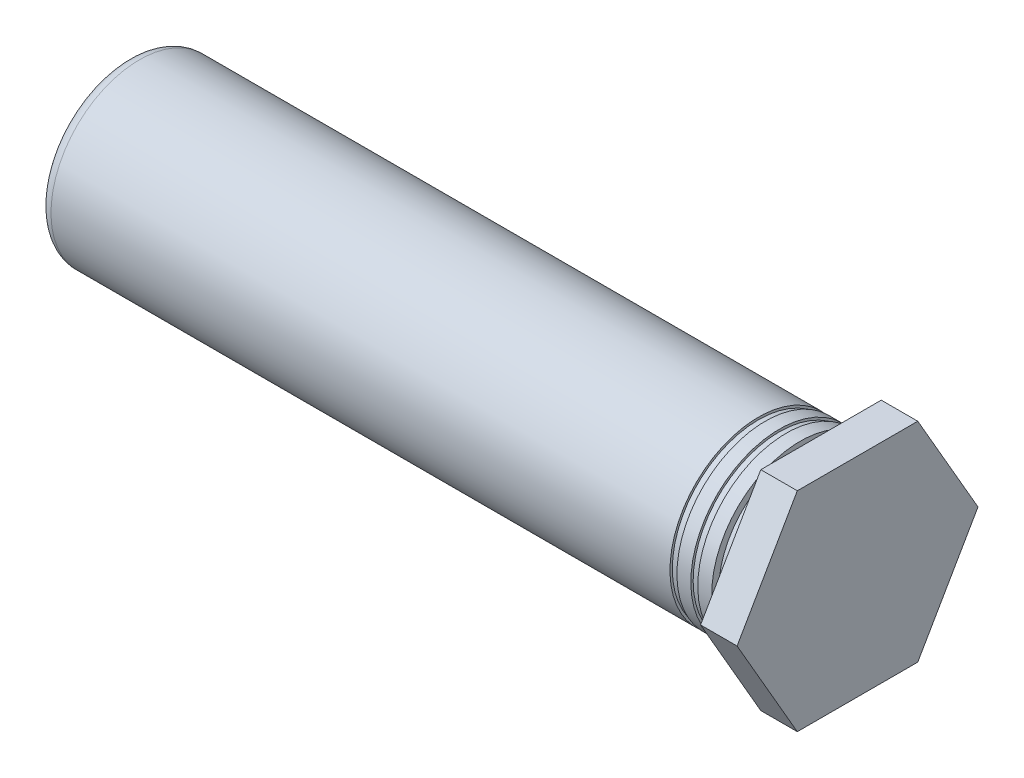
ISO-10303-21;
HEADER;
FILE_DESCRIPTION(('STEP AP214'),'2;1');
FILE_NAME('part.step','',(''),(''),'','','');
FILE_SCHEMA(('AUTOMOTIVE_DESIGN { 1 0 10303 214 1 1 1 1 }'));
ENDSEC;
DATA;
#1=APPLICATION_CONTEXT('core data for automotive mechanical design processes');
#2=APPLICATION_PROTOCOL_DEFINITION('international standard','automotive_design',2000,#1);
#3=PRODUCT_CONTEXT('',#1,'mechanical');
#4=PRODUCT('Part','Part','',(#3));
#5=PRODUCT_RELATED_PRODUCT_CATEGORY('part','',(#4));
#6=PRODUCT_DEFINITION_FORMATION('','',#4);
#7=PRODUCT_DEFINITION_CONTEXT('part definition',#1,'design');
#8=PRODUCT_DEFINITION('design','',#6,#7);
#9=PRODUCT_DEFINITION_SHAPE('','',#8);
#10=(LENGTH_UNIT() NAMED_UNIT(*) SI_UNIT(.MILLI.,.METRE.));
#11=(NAMED_UNIT(*) PLANE_ANGLE_UNIT() SI_UNIT($,.RADIAN.));
#12=(NAMED_UNIT(*) SI_UNIT($,.STERADIAN.) SOLID_ANGLE_UNIT());
#13=UNCERTAINTY_MEASURE_WITH_UNIT(LENGTH_MEASURE(1.E-05),#10,'distance_accuracy_value','');
#14=(GEOMETRIC_REPRESENTATION_CONTEXT(3) GLOBAL_UNCERTAINTY_ASSIGNED_CONTEXT((#13)) GLOBAL_UNIT_ASSIGNED_CONTEXT((#10,
#11,#12)) REPRESENTATION_CONTEXT('',''));
#15=CARTESIAN_POINT('',(0.,0.,0.));
#16=DIRECTION('',(0.,0.,1.));
#17=DIRECTION('',(1.,0.,0.));
#18=AXIS2_PLACEMENT_3D('',#15,#16,#17);
#19=CARTESIAN_POINT('',(1.11125,-1.905,0.));
#20=DIRECTION('',(1.,0.,0.));
#21=DIRECTION('',(0.,1.,0.));
#22=AXIS2_PLACEMENT_3D('',#19,#20,#21);
#23=PLANE('',#22);
#24=DIRECTION('',(0.,0.,-1.));
#25=VECTOR('',#24,1.);
#26=CARTESIAN_POINT('',(1.11125,-3.175,0.));
#27=LINE('',#26,#25);
#28=CARTESIAN_POINT('',(1.11125,-3.175,-1.83308710467706));
#29=VERTEX_POINT('',#28);
#30=CARTESIAN_POINT('',(1.11125,-3.175,1.83308710467706));
#31=VERTEX_POINT('',#30);
#32=EDGE_CURVE('E103',#29,#31,#27,.F.);
#33=ORIENTED_EDGE('',*,*,#32,.F.);
#34=DIRECTION('',(0.,0.866025403784439,-0.5));
#35=VECTOR('',#34,1.);
#36=CARTESIAN_POINT('',(1.11125,-1.5875,-2.74963065701559));
#37=LINE('',#36,#35);
#38=CARTESIAN_POINT('',(1.11125,0.,-3.66617420935412));
#39=VERTEX_POINT('',#38);
#40=EDGE_CURVE('E101',#39,#29,#37,.F.);
#41=ORIENTED_EDGE('',*,*,#40,.F.);
#42=DIRECTION('',(0.,0.866025403784438,0.500000000000001));
#43=VECTOR('',#42,1.);
#44=CARTESIAN_POINT('',(1.11125,1.5875,-2.74963065701559));
#45=LINE('',#44,#43);
#46=CARTESIAN_POINT('',(1.11125,3.175,-1.83308710467706));
#47=VERTEX_POINT('',#46);
#48=EDGE_CURVE('E90',#47,#39,#45,.F.);
#49=ORIENTED_EDGE('',*,*,#48,.F.);
#50=DIRECTION('',(0.,0.,1.));
#51=VECTOR('',#50,1.);
#52=CARTESIAN_POINT('',(1.11125,3.175,0.));
#53=LINE('',#52,#51);
#54=CARTESIAN_POINT('',(1.11125,3.175,1.83308710467706));
#55=VERTEX_POINT('',#54);
#56=EDGE_CURVE('E123',#55,#47,#53,.F.);
#57=ORIENTED_EDGE('',*,*,#56,.F.);
#58=DIRECTION('',(0.,-0.866025403784439,0.5));
#59=VECTOR('',#58,1.);
#60=CARTESIAN_POINT('',(1.11125,1.5875,2.74963065701559));
#61=LINE('',#60,#59);
#62=CARTESIAN_POINT('',(1.11125,0.,3.66617420935412));
#63=VERTEX_POINT('',#62);
#64=EDGE_CURVE('E75',#63,#55,#61,.F.);
#65=ORIENTED_EDGE('',*,*,#64,.F.);
#66=DIRECTION('',(0.,-0.866025403784438,-0.5));
#67=VECTOR('',#66,1.);
#68=CARTESIAN_POINT('',(1.11125,-1.5875,2.74963065701559));
#69=LINE('',#68,#67);
#70=EDGE_CURVE('E116',#31,#63,#69,.F.);
#71=ORIENTED_EDGE('',*,*,#70,.F.);
#72=EDGE_LOOP('',(#33,#41,#49,#57,#65,#71));
#73=FACE_BOUND('',#72,.T.);
#74=ADVANCED_FACE('F17',(#73),#23,.T.);
#75=CARTESIAN_POINT('',(0.555625,1.5875,-2.74963065701559));
#76=DIRECTION('',(0.,0.500000000000001,-0.866025403784438));
#77=DIRECTION('',(0.,0.866025403784438,0.500000000000001));
#78=AXIS2_PLACEMENT_3D('',#75,#76,#77);
#79=PLANE('',#78);
#80=DIRECTION('',(1.,0.,0.));
#81=VECTOR('',#80,1.);
#82=CARTESIAN_POINT('',(0.555625,0.,-3.66617420935412));
#83=LINE('',#82,#81);
#84=CARTESIAN_POINT('',(0.,0.,-3.66617420935412));
#85=VERTEX_POINT('',#84);
#86=EDGE_CURVE('E94',#85,#39,#83,.T.);
#87=ORIENTED_EDGE('',*,*,#86,.F.);
#88=DIRECTION('',(0.,-0.866025403784438,-0.500000000000001));
#89=VECTOR('',#88,1.);
#90=CARTESIAN_POINT('',(0.,3.175,-1.83308710467706));
#91=LINE('',#90,#89);
#92=CARTESIAN_POINT('',(0.,3.175,-1.83308710467706));
#93=VERTEX_POINT('',#92);
#94=EDGE_CURVE('E71',#93,#85,#91,.T.);
#95=ORIENTED_EDGE('',*,*,#94,.F.);
#96=DIRECTION('',(1.,0.,0.));
#97=VECTOR('',#96,1.);
#98=CARTESIAN_POINT('',(0.555625,3.175,-1.83308710467706));
#99=LINE('',#98,#97);
#100=EDGE_CURVE('E96',#47,#93,#99,.F.);
#101=ORIENTED_EDGE('',*,*,#100,.F.);
#102=ORIENTED_EDGE('',*,*,#48,.T.);
#103=EDGE_LOOP('',(#87,#95,#101,#102));
#104=FACE_BOUND('',#103,.T.);
#105=ADVANCED_FACE('F92',(#104),#79,.T.);
#106=CARTESIAN_POINT('',(0.555625,-1.5875,-2.74963065701559));
#107=DIRECTION('',(0.,-0.5,-0.866025403784439));
#108=DIRECTION('',(0.,0.866025403784439,-0.5));
#109=AXIS2_PLACEMENT_3D('',#106,#107,#108);
#110=PLANE('',#109);
#111=DIRECTION('',(1.,0.,0.));
#112=VECTOR('',#111,1.);
#113=CARTESIAN_POINT('',(0.555625,-3.175,-1.83308710467706));
#114=LINE('',#113,#112);
#115=CARTESIAN_POINT('',(0.,-3.175,-1.83308710467706));
#116=VERTEX_POINT('',#115);
#117=EDGE_CURVE('E106',#116,#29,#114,.T.);
#118=ORIENTED_EDGE('',*,*,#117,.F.);
#119=DIRECTION('',(0.,-0.866025403784439,0.5));
#120=VECTOR('',#119,1.);
#121=CARTESIAN_POINT('',(0.,0.,-3.66617420935412));
#122=LINE('',#121,#120);
#123=EDGE_CURVE('E110',#85,#116,#122,.T.);
#124=ORIENTED_EDGE('',*,*,#123,.F.);
#125=ORIENTED_EDGE('',*,*,#86,.T.);
#126=ORIENTED_EDGE('',*,*,#40,.T.);
#127=EDGE_LOOP('',(#118,#124,#125,#126));
#128=FACE_BOUND('',#127,.T.);
#129=ADVANCED_FACE('F108',(#128),#110,.T.);
#130=CARTESIAN_POINT('',(0.555625,-3.175,0.));
#131=DIRECTION('',(0.,-1.,0.));
#132=DIRECTION('',(0.,0.,-1.));
#133=AXIS2_PLACEMENT_3D('',#130,#131,#132);
#134=PLANE('',#133);
#135=DIRECTION('',(1.,0.,0.));
#136=VECTOR('',#135,1.);
#137=CARTESIAN_POINT('',(0.555625,-3.175,1.83308710467706));
#138=LINE('',#137,#136);
#139=CARTESIAN_POINT('',(0.,-3.175,1.83308710467706));
#140=VERTEX_POINT('',#139);
#141=EDGE_CURVE('E114',#140,#31,#138,.T.);
#142=ORIENTED_EDGE('',*,*,#141,.F.);
#143=DIRECTION('',(0.,0.,1.));
#144=VECTOR('',#143,1.);
#145=CARTESIAN_POINT('',(0.,-3.175,0.));
#146=LINE('',#145,#144);
#147=EDGE_CURVE('E136',#116,#140,#146,.T.);
#148=ORIENTED_EDGE('',*,*,#147,.F.);
#149=ORIENTED_EDGE('',*,*,#117,.T.);
#150=ORIENTED_EDGE('',*,*,#32,.T.);
#151=EDGE_LOOP('',(#142,#148,#149,#150));
#152=FACE_BOUND('',#151,.T.);
#153=ADVANCED_FACE('F364',(#152),#134,.T.);
#154=CARTESIAN_POINT('',(0.555625,-1.5875,2.74963065701559));
#155=DIRECTION('',(0.,-0.5,0.866025403784438));
#156=DIRECTION('',(0.,-0.866025403784438,-0.5));
#157=AXIS2_PLACEMENT_3D('',#154,#155,#156);
#158=PLANE('',#157);
#159=DIRECTION('',(1.,0.,0.));
#160=VECTOR('',#159,1.);
#161=CARTESIAN_POINT('',(0.555625,0.,3.66617420935412));
#162=LINE('',#161,#160);
#163=CARTESIAN_POINT('',(0.,0.,3.66617420935412));
#164=VERTEX_POINT('',#163);
#165=EDGE_CURVE('E118',#164,#63,#162,.T.);
#166=ORIENTED_EDGE('',*,*,#165,.F.);
#167=DIRECTION('',(0.,0.866025403784438,0.5));
#168=VECTOR('',#167,1.);
#169=CARTESIAN_POINT('',(0.,-3.175,1.83308710467706));
#170=LINE('',#169,#168);
#171=EDGE_CURVE('E133',#140,#164,#170,.T.);
#172=ORIENTED_EDGE('',*,*,#171,.F.);
#173=ORIENTED_EDGE('',*,*,#141,.T.);
#174=ORIENTED_EDGE('',*,*,#70,.T.);
#175=EDGE_LOOP('',(#166,#172,#173,#174));
#176=FACE_BOUND('',#175,.T.);
#177=ADVANCED_FACE('F357',(#176),#158,.T.);
#178=CARTESIAN_POINT('',(0.555625,1.5875,2.74963065701559));
#179=DIRECTION('',(0.,0.5,0.866025403784439));
#180=DIRECTION('',(0.,-0.866025403784439,0.5));
#181=AXIS2_PLACEMENT_3D('',#178,#179,#180);
#182=PLANE('',#181);
#183=DIRECTION('',(1.,0.,0.));
#184=VECTOR('',#183,1.);
#185=CARTESIAN_POINT('',(0.555625,3.175,1.83308710467706));
#186=LINE('',#185,#184);
#187=CARTESIAN_POINT('',(0.,3.175,1.83308710467706));
#188=VERTEX_POINT('',#187);
#189=EDGE_CURVE('E51',#188,#55,#186,.T.);
#190=ORIENTED_EDGE('',*,*,#189,.F.);
#191=DIRECTION('',(0.,0.866025403784439,-0.5));
#192=VECTOR('',#191,1.);
#193=CARTESIAN_POINT('',(0.,0.,3.66617420935412));
#194=LINE('',#193,#192);
#195=EDGE_CURVE('E130',#164,#188,#194,.T.);
#196=ORIENTED_EDGE('',*,*,#195,.F.);
#197=ORIENTED_EDGE('',*,*,#165,.T.);
#198=ORIENTED_EDGE('',*,*,#64,.T.);
#199=EDGE_LOOP('',(#190,#196,#197,#198));
#200=FACE_BOUND('',#199,.T.);
#201=ADVANCED_FACE('F349',(#200),#182,.T.);
#202=CARTESIAN_POINT('',(0.555625,3.175,0.));
#203=DIRECTION('',(0.,1.,0.));
#204=DIRECTION('',(0.,0.,1.));
#205=AXIS2_PLACEMENT_3D('',#202,#203,#204);
#206=PLANE('',#205);
#207=ORIENTED_EDGE('',*,*,#189,.T.);
#208=ORIENTED_EDGE('',*,*,#56,.T.);
#209=ORIENTED_EDGE('',*,*,#100,.T.);
#210=DIRECTION('',(0.,0.,1.));
#211=VECTOR('',#210,1.);
#212=CARTESIAN_POINT('',(0.,3.175,0.));
#213=LINE('',#212,#211);
#214=EDGE_CURVE('E127',#188,#93,#213,.F.);
#215=ORIENTED_EDGE('',*,*,#214,.F.);
#216=EDGE_LOOP('',(#207,#208,#209,#215));
#217=FACE_BOUND('',#216,.T.);
#218=ADVANCED_FACE('F224',(#217),#206,.T.);
#219=CARTESIAN_POINT('',(0.,-3.2512,0.));
#220=DIRECTION('',(-1.,0.,0.));
#221=DIRECTION('',(0.,-1.,0.));
#222=AXIS2_PLACEMENT_3D('',#219,#220,#221);
#223=PLANE('',#222);
#224=ORIENTED_EDGE('',*,*,#195,.T.);
#225=ORIENTED_EDGE('',*,*,#214,.T.);
#226=ORIENTED_EDGE('',*,*,#94,.T.);
#227=ORIENTED_EDGE('',*,*,#123,.T.);
#228=ORIENTED_EDGE('',*,*,#147,.T.);
#229=ORIENTED_EDGE('',*,*,#171,.T.);
#230=EDGE_LOOP('',(#224,#225,#226,#227,#228,#229));
#231=FACE_BOUND('',#230,.T.);
#232=CARTESIAN_POINT('',(0.,0.,0.));
#233=DIRECTION('',(-1.,0.,0.));
#234=DIRECTION('',(0.,0.,1.));
#235=AXIS2_PLACEMENT_3D('',#232,#233,#234);
#236=CIRCLE('',#235,2.48073333333333);
#237=CARTESIAN_POINT('',(0.,0.,2.48073333333333));
#238=VERTEX_POINT('',#237);
#239=EDGE_CURVE('E21',#238,#238,#236,.F.);
#240=ORIENTED_EDGE('',*,*,#239,.T.);
#241=EDGE_LOOP('',(#240));
#242=FACE_BOUND('',#241,.T.);
#243=ADVANCED_FACE('F209',(#231,#242),#223,.T.);
#244=CARTESIAN_POINT('',(0.,0.,0.));
#245=DIRECTION('',(-1.,0.,0.));
#246=DIRECTION('',(0.,0.,1.));
#247=AXIS2_PLACEMENT_3D('',#244,#245,#246);
#248=CYLINDRICAL_SURFACE('',#247,2.48073333333333);
#249=ORIENTED_EDGE('',*,*,#239,.F.);
#250=EDGE_LOOP('',(#249));
#251=FACE_BOUND('',#250,.T.);
#252=CARTESIAN_POINT('',(-0.635,0.,0.));
#253=DIRECTION('',(-1.,0.,0.));
#254=DIRECTION('',(0.,0.,1.));
#255=AXIS2_PLACEMENT_3D('',#252,#253,#254);
#256=CIRCLE('',#255,2.48073333333333);
#257=CARTESIAN_POINT('',(-0.635,0.,2.48073333333333));
#258=VERTEX_POINT('',#257);
#259=EDGE_CURVE('E202',#258,#258,#256,.F.);
#260=ORIENTED_EDGE('',*,*,#259,.T.);
#261=EDGE_LOOP('',(#260));
#262=FACE_BOUND('',#261,.T.);
#263=ADVANCED_FACE('F211',(#251,#262),#248,.T.);
#264=CARTESIAN_POINT('',(-0.635,0.,-2.58656666666667));
#265=DIRECTION('',(-1.,0.,0.));
#266=DIRECTION('',(0.,0.,1.));
#267=AXIS2_PLACEMENT_3D('',#264,#265,#266);
#268=PLANE('',#267);
#269=CARTESIAN_POINT('',(-0.635,0.,0.));
#270=DIRECTION('',(-1.,0.,0.));
#271=DIRECTION('',(0.,-1.,0.));
#272=AXIS2_PLACEMENT_3D('',#269,#270,#271);
#273=CIRCLE('',#272,2.6924);
#274=CARTESIAN_POINT('',(-0.635,-2.6924,0.));
#275=VERTEX_POINT('',#274);
#276=EDGE_CURVE('E200',#275,#275,#273,.T.);
#277=ORIENTED_EDGE('',*,*,#276,.F.);
#278=EDGE_LOOP('',(#277));
#279=FACE_BOUND('',#278,.T.);
#280=ORIENTED_EDGE('',*,*,#259,.F.);
#281=EDGE_LOOP('',(#280));
#282=FACE_BOUND('',#281,.T.);
#283=ADVANCED_FACE('F213',(#279,#282),#268,.F.);
#284=CARTESIAN_POINT('',(-10.3716666666667,0.,0.));
#285=DIRECTION('',(-1.,0.,0.));
#286=DIRECTION('',(0.,-1.,0.));
#287=AXIS2_PLACEMENT_3D('',#284,#285,#286);
#288=CYLINDRICAL_SURFACE('',#287,2.6924);
#289=CARTESIAN_POINT('',(-1.05833333333333,0.,0.));
#290=DIRECTION('',(-1.,0.,0.));
#291=DIRECTION('',(0.,-1.,0.));
#292=AXIS2_PLACEMENT_3D('',#289,#290,#291);
#293=CIRCLE('',#292,2.6924);
#294=CARTESIAN_POINT('',(-1.05833333333333,-2.6924,0.));
#295=VERTEX_POINT('',#294);
#296=EDGE_CURVE('E197',#295,#295,#293,.F.);
#297=ORIENTED_EDGE('',*,*,#296,.T.);
#298=EDGE_LOOP('',(#297));
#299=FACE_BOUND('',#298,.T.);
#300=ORIENTED_EDGE('',*,*,#276,.T.);
#301=EDGE_LOOP('',(#300));
#302=FACE_BOUND('',#301,.T.);
#303=ADVANCED_FACE('F220',(#299,#302),#288,.T.);
#304=CARTESIAN_POINT('',(-1.05833333333333,0.,-2.65712222222222));
#305=DIRECTION('',(1.,0.,0.));
#306=DIRECTION('',(0.,1.,0.));
#307=AXIS2_PLACEMENT_3D('',#304,#305,#306);
#308=PLANE('',#307);
#309=CARTESIAN_POINT('',(-1.05833333333333,0.,0.));
#310=DIRECTION('',(-1.,0.,0.));
#311=DIRECTION('',(0.,0.,1.));
#312=AXIS2_PLACEMENT_3D('',#309,#310,#311);
#313=CIRCLE('',#312,2.62184444444444);
#314=CARTESIAN_POINT('',(-1.05833333333333,0.,2.62184444444444));
#315=VERTEX_POINT('',#314);
#316=EDGE_CURVE('E193',#315,#315,#313,.F.);
#317=ORIENTED_EDGE('',*,*,#316,.T.);
#318=EDGE_LOOP('',(#317));
#319=FACE_BOUND('',#318,.T.);
#320=ORIENTED_EDGE('',*,*,#296,.F.);
#321=EDGE_LOOP('',(#320));
#322=FACE_BOUND('',#321,.T.);
#323=ADVANCED_FACE('F313',(#319,#322),#308,.F.);
#324=CARTESIAN_POINT('',(-3.33374999991065,0.,0.));
#325=DIRECTION('',(-1.,0.,0.));
#326=DIRECTION('',(0.,0.,1.));
#327=AXIS2_PLACEMENT_3D('',#324,#325,#326);
#328=CONICAL_SURFACE('',#327,1.48589999986371,1.04719755102684);
#329=CARTESIAN_POINT('',(-3.33375,0.,0.));
#330=DIRECTION('',(-1.,0.,0.));
#331=DIRECTION('',(0.,0.,1.));
#332=AXIS2_PLACEMENT_3D('',#329,#330,#331);
#333=CIRCLE('',#332,1.4859);
#334=CARTESIAN_POINT('',(-3.33374999999187,0.,1.48589999999435));
#335=VERTEX_POINT('',#334);
#336=CARTESIAN_POINT('',(-3.33374999996345,0.,-1.48589999995171));
#337=VERTEX_POINT('',#336);
#338=EDGE_CURVE('E196',#335,#337,#333,.T.);
#339=ORIENTED_EDGE('',*,*,#338,.T.);
#340=DIRECTION('',(0.5,0.,0.866025403784439));
#341=VECTOR('',#340,1.);
#342=CARTESIAN_POINT('',(-288100.260190858,-3.19832101293001E-11,-499000.));
#343=LINE('',#342,#341);
#344=CARTESIAN_POINT('',(-2.47586523488508,0.,8.52671975120917E-11));
#345=VERTEX_POINT('',#344);
#346=EDGE_CURVE('E43',#337,#345,#343,.T.);
#347=ORIENTED_EDGE('',*,*,#346,.T.);
#348=CARTESIAN_POINT('',(-2.47586523494192,0.,-1.13682699279857E-10));
#349=CARTESIAN_POINT('',(-2.51161043348895,8.17824693282667E-13,0.0619124998961029));
#350=CARTESIAN_POINT('',(-2.54735563203309,1.53164356078472E-12,0.123824999907561));
#351=CARTESIAN_POINT('',(-2.61884602912136,2.75532580991941E-12,0.247649999930476));
#352=CARTESIAN_POINT('',(-2.65459122766549,3.26518919155204E-12,0.309562499941934));
#353=CARTESIAN_POINT('',(-2.72608162473841,4.08087819563502E-12,0.433387499924879));
#354=CARTESIAN_POINT('',(-2.76182682326719,4.38670381820607E-12,0.495299999896366));
#355=CARTESIAN_POINT('',(-2.83331722035707,4.79472866909886E-12,0.619124999918354));
#356=CARTESIAN_POINT('',(-2.86906241891816,4.89692789717967E-12,0.681037499968855));
#357=CARTESIAN_POINT('',(-2.9405528160058,4.89679665020439E-12,0.804862499992136));
#358=CARTESIAN_POINT('',(-2.97629801453234,4.79446617539029E-12,0.866774999964916));
#359=CARTESIAN_POINT('',(-3.04778841162492,4.38649776959336E-12,0.990599999966397));
#360=CARTESIAN_POINT('',(-3.08353361019096,4.08085983841666E-12,1.0525124999951));
#361=CARTESIAN_POINT('',(-3.15502400728242,3.26526027199273E-12,1.17633749999722));
#362=CARTESIAN_POINT('',(-3.19076920580786,2.75529863694036E-12,1.23824999997064));
#363=CARTESIAN_POINT('',(-3.26225960287767,1.53141988121157E-12,1.36207499995538));
#364=CARTESIAN_POINT('',(-3.29800480142205,8.17502760414494E-13,1.42398749996669));
#365=CARTESIAN_POINT('',(-3.33374999996749,0.,1.4858999999774));
#366=B_SPLINE_CURVE_WITH_KNOTS('',3,(#348,#349,#350,#351,#352,#353,#354,#355,#356,#357,#358,
#359,#360,#361,#362,#363,#364,#365),.UNSPECIFIED.,.F.,.F.,(4,2,2,2,2,2,2,2,4),(0.,
0.214471191281383,0.428942382562766,0.643413573717272,0.857884765125533,1.07235595628004,
1.28682714763907,1.50129833879358,1.71576953007496),.UNSPECIFIED.);
#367=EDGE_CURVE('E35',#345,#335,#366,.T.);
#368=ORIENTED_EDGE('',*,*,#367,.T.);
#369=EDGE_LOOP('',(#339,#347,#368));
#370=FACE_BOUND('',#369,.T.);
#371=ADVANCED_FACE('F149',(#370),#328,.F.);
#372=CARTESIAN_POINT('',(-3.33374999985381,0.,0.));
#373=DIRECTION('',(-1.,0.,0.));
#374=DIRECTION('',(0.,-1.,0.));
#375=AXIS2_PLACEMENT_3D('',#372,#373,#374);
#376=CONICAL_SURFACE('',#375,1.48589999980686,1.04719755103896);
#377=ORIENTED_EDGE('',*,*,#346,.F.);
#378=CARTESIAN_POINT('',(-3.33375,0.,0.));
#379=DIRECTION('',(-1.,0.,0.));
#380=DIRECTION('',(0.,0.,1.));
#381=AXIS2_PLACEMENT_3D('',#378,#379,#380);
#382=CIRCLE('',#381,1.4859);
#383=EDGE_CURVE('E192',#337,#335,#382,.T.);
#384=ORIENTED_EDGE('',*,*,#383,.T.);
#385=ORIENTED_EDGE('',*,*,#367,.F.);
#386=EDGE_LOOP('',(#377,#384,#385));
#387=FACE_BOUND('',#386,.T.);
#388=ADVANCED_FACE('F151',(#387),#376,.F.);
#389=CARTESIAN_POINT('',(-1.05833333333333,0.,0.));
#390=DIRECTION('',(-1.,0.,0.));
#391=DIRECTION('',(0.,0.,1.));
#392=AXIS2_PLACEMENT_3D('',#389,#390,#391);
#393=CYLINDRICAL_SURFACE('',#392,2.62184444444444);
#394=ORIENTED_EDGE('',*,*,#316,.F.);
#395=EDGE_LOOP('',(#394));
#396=FACE_BOUND('',#395,.T.);
#397=CARTESIAN_POINT('',(-1.27,0.,0.));
#398=DIRECTION('',(-1.,0.,0.));
#399=DIRECTION('',(0.,0.,1.));
#400=AXIS2_PLACEMENT_3D('',#397,#398,#399);
#401=CIRCLE('',#400,2.62184444444444);
#402=CARTESIAN_POINT('',(-1.27,0.,2.62184444444444));
#403=VERTEX_POINT('',#402);
#404=EDGE_CURVE('E189',#403,#403,#401,.F.);
#405=ORIENTED_EDGE('',*,*,#404,.T.);
#406=EDGE_LOOP('',(#405));
#407=FACE_BOUND('',#406,.T.);
#408=ADVANCED_FACE('F299',(#396,#407),#393,.T.);
#409=CARTESIAN_POINT('',(-7.46125,0.,0.));
#410=DIRECTION('',(-1.,0.,0.));
#411=DIRECTION('',(0.,0.,1.));
#412=AXIS2_PLACEMENT_3D('',#409,#410,#411);
#413=CYLINDRICAL_SURFACE('',#412,1.4859);
#414=CARTESIAN_POINT('',(-11.58875,0.,0.));
#415=DIRECTION('',(-1.,0.,0.));
#416=DIRECTION('',(0.,0.,1.));
#417=AXIS2_PLACEMENT_3D('',#414,#415,#416);
#418=CIRCLE('',#417,1.4859);
#419=CARTESIAN_POINT('',(-11.58875,0.,1.4859));
#420=VERTEX_POINT('',#419);
#421=EDGE_CURVE('E186',#420,#420,#418,.F.);
#422=ORIENTED_EDGE('',*,*,#421,.F.);
#423=EDGE_LOOP('',(#422));
#424=FACE_BOUND('',#423,.T.);
#425=ORIENTED_EDGE('',*,*,#338,.F.);
#426=ORIENTED_EDGE('',*,*,#383,.F.);
#427=EDGE_LOOP('',(#425,#426));
#428=FACE_BOUND('',#427,.T.);
#429=ADVANCED_FACE('F296',(#424,#428),#413,.F.);
#430=CARTESIAN_POINT('',(-1.27,0.,-2.65712222222222));
#431=DIRECTION('',(-1.,0.,0.));
#432=DIRECTION('',(0.,0.,1.));
#433=AXIS2_PLACEMENT_3D('',#430,#431,#432);
#434=PLANE('',#433);
#435=CARTESIAN_POINT('',(-1.27,0.,0.));
#436=DIRECTION('',(-1.,0.,0.));
#437=DIRECTION('',(0.,-1.,0.));
#438=AXIS2_PLACEMENT_3D('',#435,#436,#437);
#439=CIRCLE('',#438,2.6924);
#440=CARTESIAN_POINT('',(-1.27,-2.6924,0.));
#441=VERTEX_POINT('',#440);
#442=EDGE_CURVE('E183',#441,#441,#439,.T.);
#443=ORIENTED_EDGE('',*,*,#442,.F.);
#444=EDGE_LOOP('',(#443));
#445=FACE_BOUND('',#444,.T.);
#446=ORIENTED_EDGE('',*,*,#404,.F.);
#447=EDGE_LOOP('',(#446));
#448=FACE_BOUND('',#447,.T.);
#449=ADVANCED_FACE('F292',(#445,#448),#434,.F.);
#450=CARTESIAN_POINT('',(-11.58875,0.,-1.55575));
#451=DIRECTION('',(1.,0.,0.));
#452=DIRECTION('',(0.,0.,-1.));
#453=AXIS2_PLACEMENT_3D('',#450,#451,#452);
#454=PLANE('',#453);
#455=CARTESIAN_POINT('',(-11.58875,0.,0.));
#456=DIRECTION('',(-1.,0.,0.));
#457=DIRECTION('',(0.,0.,1.));
#458=AXIS2_PLACEMENT_3D('',#455,#456,#457);
#459=CIRCLE('',#458,1.3589);
#460=CARTESIAN_POINT('',(-11.58875,0.,1.3589));
#461=VERTEX_POINT('',#460);
#462=EDGE_CURVE('E180',#461,#461,#459,.F.);
#463=ORIENTED_EDGE('',*,*,#462,.F.);
#464=EDGE_LOOP('',(#463));
#465=FACE_BOUND('',#464,.T.);
#466=ORIENTED_EDGE('',*,*,#421,.T.);
#467=EDGE_LOOP('',(#466));
#468=FACE_BOUND('',#467,.T.);
#469=ADVANCED_FACE('F288',(#465,#468),#454,.T.);
#470=CARTESIAN_POINT('',(-10.3716666666667,0.,0.));
#471=DIRECTION('',(-1.,0.,0.));
#472=DIRECTION('',(0.,-1.,0.));
#473=AXIS2_PLACEMENT_3D('',#470,#471,#472);
#474=CYLINDRICAL_SURFACE('',#473,2.6924);
#475=CARTESIAN_POINT('',(-1.69333333333333,0.,0.));
#476=DIRECTION('',(-1.,0.,0.));
#477=DIRECTION('',(0.,-1.,0.));
#478=AXIS2_PLACEMENT_3D('',#475,#476,#477);
#479=CIRCLE('',#478,2.6924);
#480=CARTESIAN_POINT('',(-1.69333333333333,-2.6924,0.));
#481=VERTEX_POINT('',#480);
#482=EDGE_CURVE('E177',#481,#481,#479,.F.);
#483=ORIENTED_EDGE('',*,*,#482,.T.);
#484=EDGE_LOOP('',(#483));
#485=FACE_BOUND('',#484,.T.);
#486=ORIENTED_EDGE('',*,*,#442,.T.);
#487=EDGE_LOOP('',(#486));
#488=FACE_BOUND('',#487,.T.);
#489=ADVANCED_FACE('F284',(#485,#488),#474,.T.);
#490=CARTESIAN_POINT('',(-11.58875,0.,0.));
#491=DIRECTION('',(-1.,0.,0.));
#492=DIRECTION('',(0.,0.,1.));
#493=AXIS2_PLACEMENT_3D('',#490,#491,#492);
#494=CYLINDRICAL_SURFACE('',#493,1.3589);
#495=ORIENTED_EDGE('',*,*,#462,.T.);
#496=EDGE_LOOP('',(#495));
#497=FACE_BOUND('',#496,.T.);
#498=CARTESIAN_POINT('',(-20.7200500000226,0.,0.));
#499=DIRECTION('',(-1.,0.,0.));
#500=DIRECTION('',(0.,0.,-1.));
#501=AXIS2_PLACEMENT_3D('',#498,#499,#500);
#502=CIRCLE('',#501,1.35889999995698);
#503=CARTESIAN_POINT('',(-20.7200500000226,0.,-1.35889999995698));
#504=VERTEX_POINT('',#503);
#505=EDGE_CURVE('E176',#504,#504,#502,.F.);
#506=ORIENTED_EDGE('',*,*,#505,.F.);
#507=EDGE_LOOP('',(#506));
#508=FACE_BOUND('',#507,.T.);
#509=ADVANCED_FACE('F280',(#497,#508),#494,.F.);
#510=CARTESIAN_POINT('',(-1.69333333333333,0.,-2.65712222222222));
#511=DIRECTION('',(1.,0.,0.));
#512=DIRECTION('',(0.,1.,0.));
#513=AXIS2_PLACEMENT_3D('',#510,#511,#512);
#514=PLANE('',#513);
#515=CARTESIAN_POINT('',(-1.69333333333333,0.,0.));
#516=DIRECTION('',(-1.,0.,0.));
#517=DIRECTION('',(0.,0.,1.));
#518=AXIS2_PLACEMENT_3D('',#515,#516,#517);
#519=CIRCLE('',#518,2.62184444444444);
#520=CARTESIAN_POINT('',(-1.69333333333333,0.,2.62184444444444));
#521=VERTEX_POINT('',#520);
#522=EDGE_CURVE('E173',#521,#521,#519,.F.);
#523=ORIENTED_EDGE('',*,*,#522,.T.);
#524=EDGE_LOOP('',(#523));
#525=FACE_BOUND('',#524,.T.);
#526=ORIENTED_EDGE('',*,*,#482,.F.);
#527=EDGE_LOOP('',(#526));
#528=FACE_BOUND('',#527,.T.);
#529=ADVANCED_FACE('F276',(#525,#528),#514,.F.);
#530=CARTESIAN_POINT('',(-20.7200500000226,0.,0.));
#531=DIRECTION('',(-1.,0.,0.));
#532=DIRECTION('',(0.,0.,1.));
#533=AXIS2_PLACEMENT_3D('',#530,#531,#532);
#534=CONICAL_SURFACE('',#533,1.35889999995698,0.78539816346964);
#535=ORIENTED_EDGE('',*,*,#505,.T.);
#536=EDGE_LOOP('',(#535));
#537=FACE_BOUND('',#536,.T.);
#538=CARTESIAN_POINT('',(-21.1137499999268,0.,0.));
#539=DIRECTION('',(-1.,0.,0.));
#540=DIRECTION('',(0.,0.,1.));
#541=AXIS2_PLACEMENT_3D('',#538,#539,#540);
#542=CIRCLE('',#541,1.75259999991795);
#543=CARTESIAN_POINT('',(-21.1137499999268,0.,1.75259999991795));
#544=VERTEX_POINT('',#543);
#545=EDGE_CURVE('E170',#544,#544,#542,.F.);
#546=ORIENTED_EDGE('',*,*,#545,.F.);
#547=EDGE_LOOP('',(#546));
#548=FACE_BOUND('',#547,.T.);
#549=ADVANCED_FACE('F272',(#537,#548),#534,.F.);
#550=CARTESIAN_POINT('',(-1.69333333333333,0.,0.));
#551=DIRECTION('',(-1.,0.,0.));
#552=DIRECTION('',(0.,0.,1.));
#553=AXIS2_PLACEMENT_3D('',#550,#551,#552);
#554=CYLINDRICAL_SURFACE('',#553,2.62184444444444);
#555=ORIENTED_EDGE('',*,*,#522,.F.);
#556=EDGE_LOOP('',(#555));
#557=FACE_BOUND('',#556,.T.);
#558=CARTESIAN_POINT('',(-1.905,0.,0.));
#559=DIRECTION('',(-1.,0.,0.));
#560=DIRECTION('',(0.,0.,1.));
#561=AXIS2_PLACEMENT_3D('',#558,#559,#560);
#562=CIRCLE('',#561,2.62184444444444);
#563=CARTESIAN_POINT('',(-1.905,0.,2.62184444444444));
#564=VERTEX_POINT('',#563);
#565=EDGE_CURVE('E167',#564,#564,#562,.F.);
#566=ORIENTED_EDGE('',*,*,#565,.T.);
#567=EDGE_LOOP('',(#566));
#568=FACE_BOUND('',#567,.T.);
#569=ADVANCED_FACE('F269',(#557,#568),#554,.T.);
#570=CARTESIAN_POINT('',(-21.11375,-1.16099166666667,0.));
#571=DIRECTION('',(-1.,0.,0.));
#572=DIRECTION('',(0.,-1.,0.));
#573=AXIS2_PLACEMENT_3D('',#570,#571,#572);
#574=PLANE('',#573);
#575=CARTESIAN_POINT('',(-21.11375,0.,0.));
#576=DIRECTION('',(1.,0.,0.));
#577=DIRECTION('',(0.,-1.,0.));
#578=AXIS2_PLACEMENT_3D('',#575,#576,#577);
#579=CIRCLE('',#578,2.32198333333333);
#580=CARTESIAN_POINT('',(-21.11375,-2.32198333333333,0.));
#581=VERTEX_POINT('',#580);
#582=EDGE_CURVE('E166',#581,#581,#579,.T.);
#583=ORIENTED_EDGE('',*,*,#582,.F.);
#584=EDGE_LOOP('',(#583));
#585=FACE_BOUND('',#584,.T.);
#586=ORIENTED_EDGE('',*,*,#545,.T.);
#587=EDGE_LOOP('',(#586));
#588=FACE_BOUND('',#587,.T.);
#589=ADVANCED_FACE('F260',(#585,#588),#574,.T.);
#590=CARTESIAN_POINT('',(-1.905,0.,-2.65712222222222));
#591=DIRECTION('',(-1.,0.,0.));
#592=DIRECTION('',(0.,0.,1.));
#593=AXIS2_PLACEMENT_3D('',#590,#591,#592);
#594=PLANE('',#593);
#595=CARTESIAN_POINT('',(-1.905,0.,0.));
#596=DIRECTION('',(-1.,0.,0.));
#597=DIRECTION('',(0.,-1.,0.));
#598=AXIS2_PLACEMENT_3D('',#595,#596,#597);
#599=CIRCLE('',#598,2.6924);
#600=CARTESIAN_POINT('',(-1.905,-2.6924,0.));
#601=VERTEX_POINT('',#600);
#602=EDGE_CURVE('E27',#601,#601,#599,.T.);
#603=ORIENTED_EDGE('',*,*,#602,.F.);
#604=EDGE_LOOP('',(#603));
#605=FACE_BOUND('',#604,.T.);
#606=ORIENTED_EDGE('',*,*,#565,.F.);
#607=EDGE_LOOP('',(#606));
#608=FACE_BOUND('',#607,.T.);
#609=ADVANCED_FACE('F234',(#605,#608),#594,.F.);
#610=CARTESIAN_POINT('',(-20.7433333333333,0.,0.));
#611=DIRECTION('',(-1.,0.,0.));
#612=DIRECTION('',(0.,-1.,0.));
#613=AXIS2_PLACEMENT_3D('',#610,#611,#612);
#614=TOROIDAL_SURFACE('',#613,2.32198333333333,0.370416666666667);
#615=CARTESIAN_POINT('',(-20.7433333333333,0.,0.));
#616=DIRECTION('',(-1.,0.,0.));
#617=DIRECTION('',(0.,-1.,0.));
#618=AXIS2_PLACEMENT_3D('',#615,#616,#617);
#619=CIRCLE('',#618,2.6924);
#620=CARTESIAN_POINT('',(-20.7433333333333,-2.6924,0.));
#621=VERTEX_POINT('',#620);
#622=EDGE_CURVE('E11',#621,#621,#619,.F.);
#623=ORIENTED_EDGE('',*,*,#622,.F.);
#624=EDGE_LOOP('',(#623));
#625=FACE_BOUND('',#624,.T.);
#626=ORIENTED_EDGE('',*,*,#582,.T.);
#627=EDGE_LOOP('',(#626));
#628=FACE_BOUND('',#627,.T.);
#629=ADVANCED_FACE('F228',(#625,#628),#614,.T.);
#630=CARTESIAN_POINT('',(-10.3716666666667,0.,0.));
#631=DIRECTION('',(-1.,0.,0.));
#632=DIRECTION('',(0.,-1.,0.));
#633=AXIS2_PLACEMENT_3D('',#630,#631,#632);
#634=CYLINDRICAL_SURFACE('',#633,2.6924);
#635=ORIENTED_EDGE('',*,*,#602,.T.);
#636=EDGE_LOOP('',(#635));
#637=FACE_BOUND('',#636,.T.);
#638=ORIENTED_EDGE('',*,*,#622,.T.);
#639=EDGE_LOOP('',(#638));
#640=FACE_BOUND('',#639,.T.);
#641=ADVANCED_FACE('F19',(#637,#640),#634,.T.);
#642=CLOSED_SHELL('',(#74,#105,#129,#153,#177,#201,#218,#243,#263,#283,#303,#323,#371,#388,#408,
#429,#449,#469,#489,#509,#529,#549,#569,#589,#609,#629,#641));
#643=MANIFOLD_SOLID_BREP('B1',#642);
#644=ADVANCED_BREP_SHAPE_REPRESENTATION('',(#18,#643),#14);
#645=SHAPE_DEFINITION_REPRESENTATION(#9,#644);
ENDSEC;
END-ISO-10303-21;
